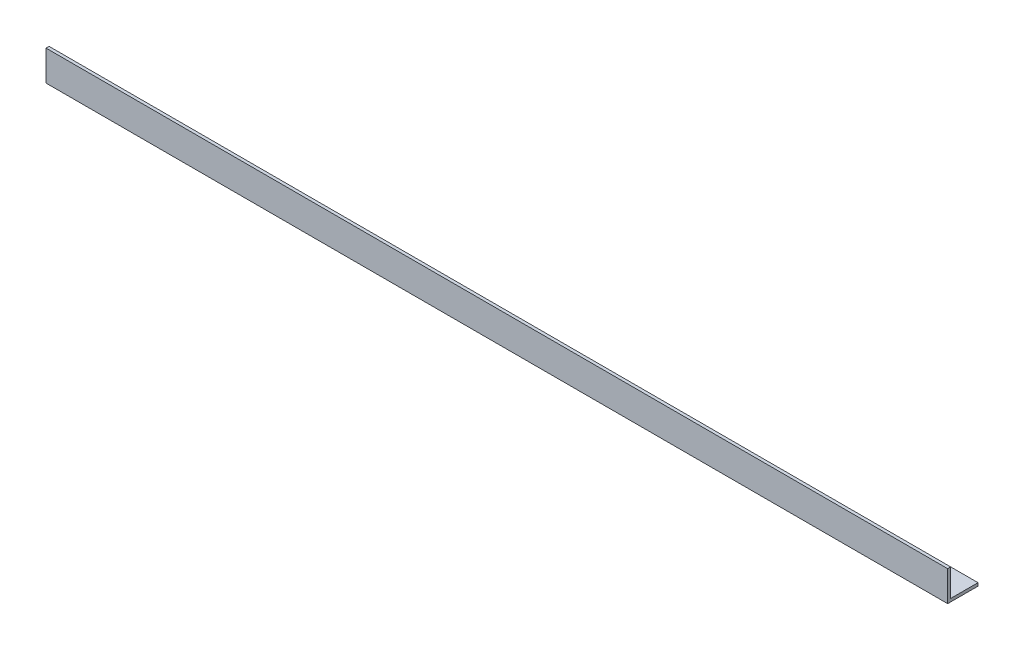
ISO-10303-21;
HEADER;
FILE_DESCRIPTION(('STEP AP214'),'2;1');
FILE_NAME('part.step','',(''),(''),'','','');
FILE_SCHEMA(('AUTOMOTIVE_DESIGN { 1 0 10303 214 1 1 1 1 }'));
ENDSEC;
DATA;
#1=APPLICATION_CONTEXT('core data for automotive mechanical design processes');
#2=APPLICATION_PROTOCOL_DEFINITION('international standard','automotive_design',2000,#1);
#3=PRODUCT_CONTEXT('',#1,'mechanical');
#4=PRODUCT('Part','Part','',(#3));
#5=PRODUCT_RELATED_PRODUCT_CATEGORY('part','',(#4));
#6=PRODUCT_DEFINITION_FORMATION('','',#4);
#7=PRODUCT_DEFINITION_CONTEXT('part definition',#1,'design');
#8=PRODUCT_DEFINITION('design','',#6,#7);
#9=PRODUCT_DEFINITION_SHAPE('','',#8);
#10=(LENGTH_UNIT() NAMED_UNIT(*) SI_UNIT(.MILLI.,.METRE.));
#11=(NAMED_UNIT(*) PLANE_ANGLE_UNIT() SI_UNIT($,.RADIAN.));
#12=(NAMED_UNIT(*) SI_UNIT($,.STERADIAN.) SOLID_ANGLE_UNIT());
#13=UNCERTAINTY_MEASURE_WITH_UNIT(LENGTH_MEASURE(1.E-05),#10,'distance_accuracy_value','');
#14=(GEOMETRIC_REPRESENTATION_CONTEXT(3) GLOBAL_UNCERTAINTY_ASSIGNED_CONTEXT((#13)) GLOBAL_UNIT_ASSIGNED_CONTEXT((#10,
#11,#12)) REPRESENTATION_CONTEXT('',''));
#15=CARTESIAN_POINT('',(0.,0.,0.));
#16=DIRECTION('',(0.,0.,1.));
#17=DIRECTION('',(1.,0.,0.));
#18=AXIS2_PLACEMENT_3D('',#15,#16,#17);
#19=CARTESIAN_POINT('',(446.,0.,-15.));
#20=DIRECTION('',(0.,1.,0.));
#21=DIRECTION('',(0.,0.,1.));
#22=AXIS2_PLACEMENT_3D('',#19,#20,#21);
#23=PLANE('',#22);
#24=DIRECTION('',(0.,0.,-1.));
#25=VECTOR('',#24,1.);
#26=CARTESIAN_POINT('',(0.,0.,-15.));
#27=LINE('',#26,#25);
#28=CARTESIAN_POINT('',(0.,0.,0.));
#29=VERTEX_POINT('',#28);
#30=CARTESIAN_POINT('',(0.,0.,-15.));
#31=VERTEX_POINT('',#30);
#32=EDGE_CURVE('E118',#29,#31,#27,.T.);
#33=ORIENTED_EDGE('',*,*,#32,.T.);
#34=DIRECTION('',(-1.,0.,0.));
#35=VECTOR('',#34,1.);
#36=CARTESIAN_POINT('',(446.,0.,-15.));
#37=LINE('',#36,#35);
#38=CARTESIAN_POINT('',(446.,0.,-15.));
#39=VERTEX_POINT('',#38);
#40=EDGE_CURVE('E11',#39,#31,#37,.T.);
#41=ORIENTED_EDGE('',*,*,#40,.F.);
#42=DIRECTION('',(0.,0.,-1.));
#43=VECTOR('',#42,1.);
#44=CARTESIAN_POINT('',(446.,0.,-15.));
#45=LINE('',#44,#43);
#46=CARTESIAN_POINT('',(446.,0.,0.));
#47=VERTEX_POINT('',#46);
#48=EDGE_CURVE('E128',#47,#39,#45,.T.);
#49=ORIENTED_EDGE('',*,*,#48,.F.);
#50=DIRECTION('',(-1.,0.,0.));
#51=VECTOR('',#50,1.);
#52=CARTESIAN_POINT('',(446.,0.,0.));
#53=LINE('',#52,#51);
#54=EDGE_CURVE('E114',#47,#29,#53,.T.);
#55=ORIENTED_EDGE('',*,*,#54,.T.);
#56=EDGE_LOOP('',(#33,#41,#49,#55));
#57=FACE_BOUND('',#56,.T.);
#58=ADVANCED_FACE('F34',(#57),#23,.F.);
#59=CARTESIAN_POINT('',(446.,1.49999999999998,-15.));
#60=DIRECTION('',(0.,0.,1.));
#61=DIRECTION('',(1.,0.,0.));
#62=AXIS2_PLACEMENT_3D('',#59,#60,#61);
#63=PLANE('',#62);
#64=DIRECTION('',(0.,1.,0.));
#65=VECTOR('',#64,1.);
#66=CARTESIAN_POINT('',(0.,1.49999999999998,-15.));
#67=LINE('',#66,#65);
#68=CARTESIAN_POINT('',(0.,1.49999999999998,-15.));
#69=VERTEX_POINT('',#68);
#70=EDGE_CURVE('E121',#31,#69,#67,.T.);
#71=ORIENTED_EDGE('',*,*,#70,.T.);
#72=DIRECTION('',(-1.,0.,0.));
#73=VECTOR('',#72,1.);
#74=CARTESIAN_POINT('',(446.,1.49999999999998,-15.));
#75=LINE('',#74,#73);
#76=CARTESIAN_POINT('',(446.,1.49999999999998,-15.));
#77=VERTEX_POINT('',#76);
#78=EDGE_CURVE('E42',#77,#69,#75,.T.);
#79=ORIENTED_EDGE('',*,*,#78,.F.);
#80=DIRECTION('',(0.,1.,0.));
#81=VECTOR('',#80,1.);
#82=CARTESIAN_POINT('',(446.,1.49999999999998,-15.));
#83=LINE('',#82,#81);
#84=EDGE_CURVE('E87',#39,#77,#83,.T.);
#85=ORIENTED_EDGE('',*,*,#84,.F.);
#86=ORIENTED_EDGE('',*,*,#40,.T.);
#87=EDGE_LOOP('',(#71,#79,#85,#86));
#88=FACE_BOUND('',#87,.T.);
#89=ADVANCED_FACE('F152',(#88),#63,.F.);
#90=CARTESIAN_POINT('',(446.,1.5,-1.50000000000002));
#91=DIRECTION('',(0.,-1.,0.));
#92=DIRECTION('',(0.,0.,-1.));
#93=AXIS2_PLACEMENT_3D('',#90,#91,#92);
#94=PLANE('',#93);
#95=DIRECTION('',(0.,0.,1.));
#96=VECTOR('',#95,1.);
#97=CARTESIAN_POINT('',(0.,1.5,-1.50000000000002));
#98=LINE('',#97,#96);
#99=CARTESIAN_POINT('',(0.,1.5,-1.50000000000002));
#100=VERTEX_POINT('',#99);
#101=EDGE_CURVE('E123',#69,#100,#98,.T.);
#102=ORIENTED_EDGE('',*,*,#101,.T.);
#103=DIRECTION('',(-1.,0.,0.));
#104=VECTOR('',#103,1.);
#105=CARTESIAN_POINT('',(446.,1.5,-1.50000000000002));
#106=LINE('',#105,#104);
#107=CARTESIAN_POINT('',(446.,1.5,-1.50000000000002));
#108=VERTEX_POINT('',#107);
#109=EDGE_CURVE('E109',#108,#100,#106,.T.);
#110=ORIENTED_EDGE('',*,*,#109,.F.);
#111=DIRECTION('',(0.,0.,1.));
#112=VECTOR('',#111,1.);
#113=CARTESIAN_POINT('',(446.,1.5,-1.50000000000002));
#114=LINE('',#113,#112);
#115=EDGE_CURVE('E100',#77,#108,#114,.T.);
#116=ORIENTED_EDGE('',*,*,#115,.F.);
#117=ORIENTED_EDGE('',*,*,#78,.T.);
#118=EDGE_LOOP('',(#102,#110,#116,#117));
#119=FACE_BOUND('',#118,.T.);
#120=ADVANCED_FACE('F134',(#119),#94,.F.);
#121=CARTESIAN_POINT('',(446.,15.,-1.5));
#122=DIRECTION('',(0.,0.,1.));
#123=DIRECTION('',(0.,-1.,0.));
#124=AXIS2_PLACEMENT_3D('',#121,#122,#123);
#125=PLANE('',#124);
#126=DIRECTION('',(0.,1.,0.));
#127=VECTOR('',#126,1.);
#128=CARTESIAN_POINT('',(0.,15.,-1.5));
#129=LINE('',#128,#127);
#130=CARTESIAN_POINT('',(0.,15.,-1.5));
#131=VERTEX_POINT('',#130);
#132=EDGE_CURVE('E108',#100,#131,#129,.T.);
#133=ORIENTED_EDGE('',*,*,#132,.T.);
#134=DIRECTION('',(-1.,0.,0.));
#135=VECTOR('',#134,1.);
#136=CARTESIAN_POINT('',(446.,15.,-1.5));
#137=LINE('',#136,#135);
#138=CARTESIAN_POINT('',(446.,15.,-1.5));
#139=VERTEX_POINT('',#138);
#140=EDGE_CURVE('E105',#139,#131,#137,.T.);
#141=ORIENTED_EDGE('',*,*,#140,.F.);
#142=DIRECTION('',(0.,1.,0.));
#143=VECTOR('',#142,1.);
#144=CARTESIAN_POINT('',(446.,15.,-1.5));
#145=LINE('',#144,#143);
#146=EDGE_CURVE('E94',#108,#139,#145,.T.);
#147=ORIENTED_EDGE('',*,*,#146,.F.);
#148=ORIENTED_EDGE('',*,*,#109,.T.);
#149=EDGE_LOOP('',(#133,#141,#147,#148));
#150=FACE_BOUND('',#149,.T.);
#151=ADVANCED_FACE('F106',(#150),#125,.F.);
#152=CARTESIAN_POINT('',(446.,15.,0.));
#153=DIRECTION('',(0.,-1.,0.));
#154=DIRECTION('',(0.,0.,-1.));
#155=AXIS2_PLACEMENT_3D('',#152,#153,#154);
#156=PLANE('',#155);
#157=DIRECTION('',(0.,0.,1.));
#158=VECTOR('',#157,1.);
#159=CARTESIAN_POINT('',(0.,15.,0.));
#160=LINE('',#159,#158);
#161=CARTESIAN_POINT('',(0.,15.,0.));
#162=VERTEX_POINT('',#161);
#163=EDGE_CURVE('E73',#131,#162,#160,.T.);
#164=ORIENTED_EDGE('',*,*,#163,.T.);
#165=DIRECTION('',(-1.,0.,0.));
#166=VECTOR('',#165,1.);
#167=CARTESIAN_POINT('',(446.,15.,0.));
#168=LINE('',#167,#166);
#169=CARTESIAN_POINT('',(446.,15.,0.));
#170=VERTEX_POINT('',#169);
#171=EDGE_CURVE('E110',#170,#162,#168,.T.);
#172=ORIENTED_EDGE('',*,*,#171,.F.);
#173=DIRECTION('',(0.,0.,1.));
#174=VECTOR('',#173,1.);
#175=CARTESIAN_POINT('',(446.,15.,0.));
#176=LINE('',#175,#174);
#177=EDGE_CURVE('E98',#139,#170,#176,.T.);
#178=ORIENTED_EDGE('',*,*,#177,.F.);
#179=ORIENTED_EDGE('',*,*,#140,.T.);
#180=EDGE_LOOP('',(#164,#172,#178,#179));
#181=FACE_BOUND('',#180,.T.);
#182=ADVANCED_FACE('F112',(#181),#156,.F.);
#183=CARTESIAN_POINT('',(446.,0.,0.));
#184=DIRECTION('',(0.,0.,-1.));
#185=DIRECTION('',(-1.,0.,0.));
#186=AXIS2_PLACEMENT_3D('',#183,#184,#185);
#187=PLANE('',#186);
#188=DIRECTION('',(0.,-1.,0.));
#189=VECTOR('',#188,1.);
#190=CARTESIAN_POINT('',(0.,0.,0.));
#191=LINE('',#190,#189);
#192=EDGE_CURVE('E79',#162,#29,#191,.T.);
#193=ORIENTED_EDGE('',*,*,#192,.T.);
#194=ORIENTED_EDGE('',*,*,#54,.F.);
#195=DIRECTION('',(0.,-1.,0.));
#196=VECTOR('',#195,1.);
#197=CARTESIAN_POINT('',(446.,0.,0.));
#198=LINE('',#197,#196);
#199=EDGE_CURVE('E50',#170,#47,#198,.T.);
#200=ORIENTED_EDGE('',*,*,#199,.F.);
#201=ORIENTED_EDGE('',*,*,#171,.T.);
#202=EDGE_LOOP('',(#193,#194,#200,#201));
#203=FACE_BOUND('',#202,.T.);
#204=ADVANCED_FACE('F141',(#203),#187,.F.);
#205=CARTESIAN_POINT('',(446.,0.,0.));
#206=DIRECTION('',(-1.,0.,0.));
#207=DIRECTION('',(0.,0.,1.));
#208=AXIS2_PLACEMENT_3D('',#205,#206,#207);
#209=PLANE('',#208);
#210=ORIENTED_EDGE('',*,*,#48,.T.);
#211=ORIENTED_EDGE('',*,*,#84,.T.);
#212=ORIENTED_EDGE('',*,*,#115,.T.);
#213=ORIENTED_EDGE('',*,*,#146,.T.);
#214=ORIENTED_EDGE('',*,*,#177,.T.);
#215=ORIENTED_EDGE('',*,*,#199,.T.);
#216=EDGE_LOOP('',(#210,#211,#212,#213,#214,#215));
#217=FACE_BOUND('',#216,.T.);
#218=ADVANCED_FACE('F96',(#217),#209,.F.);
#219=CARTESIAN_POINT('',(0.,0.,0.));
#220=DIRECTION('',(-1.,0.,0.));
#221=DIRECTION('',(0.,0.,1.));
#222=AXIS2_PLACEMENT_3D('',#219,#220,#221);
#223=PLANE('',#222);
#224=ORIENTED_EDGE('',*,*,#32,.F.);
#225=ORIENTED_EDGE('',*,*,#192,.F.);
#226=ORIENTED_EDGE('',*,*,#163,.F.);
#227=ORIENTED_EDGE('',*,*,#132,.F.);
#228=ORIENTED_EDGE('',*,*,#101,.F.);
#229=ORIENTED_EDGE('',*,*,#70,.F.);
#230=EDGE_LOOP('',(#224,#225,#226,#227,#228,#229));
#231=FACE_BOUND('',#230,.T.);
#232=ADVANCED_FACE('F137',(#231),#223,.T.);
#233=CLOSED_SHELL('',(#58,#89,#120,#151,#182,#204,#218,#232));
#234=MANIFOLD_SOLID_BREP('B2',#233);
#235=ADVANCED_BREP_SHAPE_REPRESENTATION('',(#18,#234),#14);
#236=SHAPE_DEFINITION_REPRESENTATION(#9,#235);
ENDSEC;
END-ISO-10303-21;
